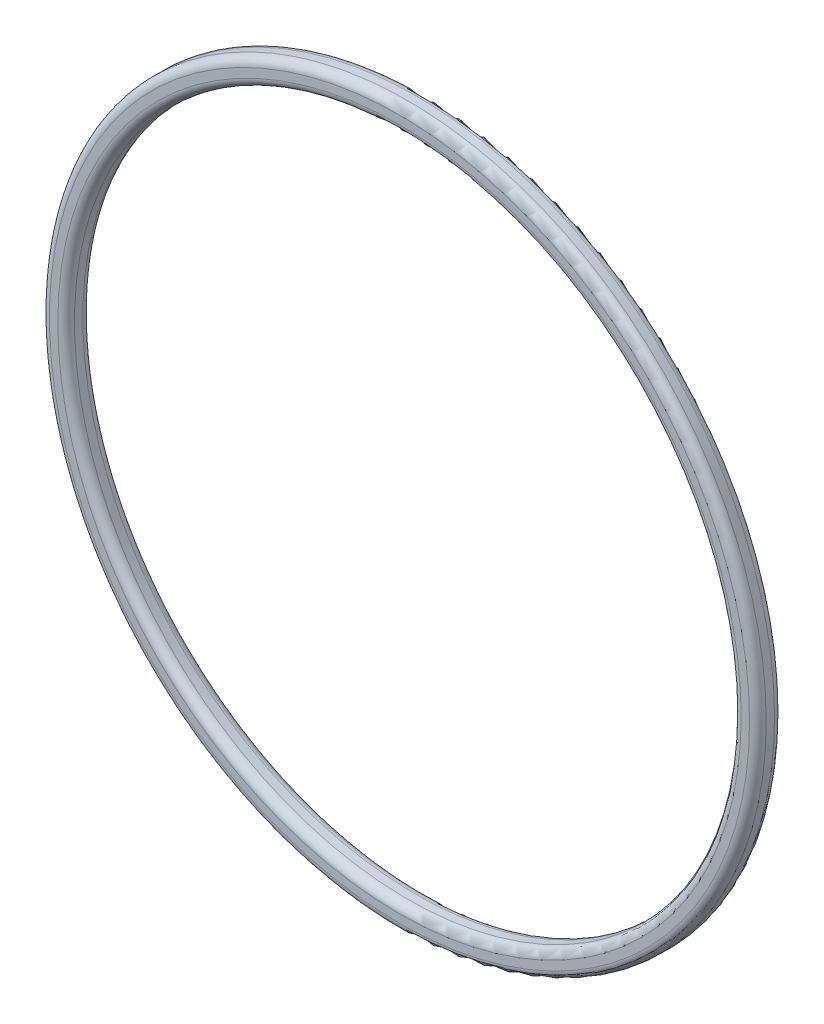
ISO-10303-21;
HEADER;
FILE_DESCRIPTION(('STEP AP214'),'2;1');
FILE_NAME('part.step','',(''),(''),'','','');
FILE_SCHEMA(('AUTOMOTIVE_DESIGN { 1 0 10303 214 1 1 1 1 }'));
ENDSEC;
DATA;
#1=APPLICATION_CONTEXT('core data for automotive mechanical design processes');
#2=APPLICATION_PROTOCOL_DEFINITION('international standard','automotive_design',2000,#1);
#3=PRODUCT_CONTEXT('',#1,'mechanical');
#4=PRODUCT('Part','Part','',(#3));
#5=PRODUCT_RELATED_PRODUCT_CATEGORY('part','',(#4));
#6=PRODUCT_DEFINITION_FORMATION('','',#4);
#7=PRODUCT_DEFINITION_CONTEXT('part definition',#1,'design');
#8=PRODUCT_DEFINITION('design','',#6,#7);
#9=PRODUCT_DEFINITION_SHAPE('','',#8);
#10=(LENGTH_UNIT() NAMED_UNIT(*) SI_UNIT(.MILLI.,.METRE.));
#11=(NAMED_UNIT(*) PLANE_ANGLE_UNIT() SI_UNIT($,.RADIAN.));
#12=(NAMED_UNIT(*) SI_UNIT($,.STERADIAN.) SOLID_ANGLE_UNIT());
#13=UNCERTAINTY_MEASURE_WITH_UNIT(LENGTH_MEASURE(1.E-05),#10,'distance_accuracy_value','');
#14=(GEOMETRIC_REPRESENTATION_CONTEXT(3) GLOBAL_UNCERTAINTY_ASSIGNED_CONTEXT((#13)) GLOBAL_UNIT_ASSIGNED_CONTEXT((#10,
#11,#12)) REPRESENTATION_CONTEXT('',''));
#15=CARTESIAN_POINT('',(0.,0.,0.));
#16=DIRECTION('',(0.,0.,1.));
#17=DIRECTION('',(1.,0.,0.));
#18=AXIS2_PLACEMENT_3D('',#15,#16,#17);
#19=CARTESIAN_POINT('',(0.,0.,3.));
#20=DIRECTION('',(0.,0.,1.));
#21=DIRECTION('',(1.,0.,0.));
#22=AXIS2_PLACEMENT_3D('',#19,#20,#21);
#23=PLANE('',#22);
#24=CARTESIAN_POINT('',(0.,0.,3.));
#25=DIRECTION('',(0.,0.,1.));
#26=DIRECTION('',(1.,0.,0.));
#27=AXIS2_PLACEMENT_3D('',#24,#25,#26);
#28=CIRCLE('',#27,41.);
#29=CARTESIAN_POINT('',(41.,0.,3.));
#30=VERTEX_POINT('',#29);
#31=EDGE_CURVE('E10',#30,#30,#28,.F.);
#32=ORIENTED_EDGE('',*,*,#31,.T.);
#33=EDGE_LOOP('',(#32));
#34=FACE_BOUND('',#33,.T.);
#35=CARTESIAN_POINT('',(0.,0.,3.));
#36=DIRECTION('',(0.,0.,1.));
#37=DIRECTION('',(1.,0.,0.));
#38=AXIS2_PLACEMENT_3D('',#35,#36,#37);
#39=CIRCLE('',#38,42.);
#40=CARTESIAN_POINT('',(42.,0.,3.));
#41=VERTEX_POINT('',#40);
#42=EDGE_CURVE('E45',#41,#41,#39,.T.);
#43=ORIENTED_EDGE('',*,*,#42,.T.);
#44=EDGE_LOOP('',(#43));
#45=FACE_BOUND('',#44,.T.);
#46=ADVANCED_FACE('F37',(#34,#45),#23,.T.);
#47=CARTESIAN_POINT('',(0.,0.,0.));
#48=DIRECTION('',(0.,0.,1.));
#49=DIRECTION('',(1.,0.,0.));
#50=AXIS2_PLACEMENT_3D('',#47,#48,#49);
#51=PLANE('',#50);
#52=CARTESIAN_POINT('',(0.,0.,0.));
#53=DIRECTION('',(0.,0.,1.));
#54=DIRECTION('',(1.,0.,0.));
#55=AXIS2_PLACEMENT_3D('',#52,#53,#54);
#56=CIRCLE('',#55,41.);
#57=CARTESIAN_POINT('',(41.,0.,0.));
#58=VERTEX_POINT('',#57);
#59=EDGE_CURVE('E69',#58,#58,#56,.T.);
#60=ORIENTED_EDGE('',*,*,#59,.T.);
#61=EDGE_LOOP('',(#60));
#62=FACE_BOUND('',#61,.T.);
#63=CARTESIAN_POINT('',(0.,0.,0.));
#64=DIRECTION('',(0.,0.,1.));
#65=DIRECTION('',(1.,0.,0.));
#66=AXIS2_PLACEMENT_3D('',#63,#64,#65);
#67=CIRCLE('',#66,42.);
#68=CARTESIAN_POINT('',(42.,0.,0.));
#69=VERTEX_POINT('',#68);
#70=EDGE_CURVE('E73',#69,#69,#67,.F.);
#71=ORIENTED_EDGE('',*,*,#70,.T.);
#72=EDGE_LOOP('',(#71));
#73=FACE_BOUND('',#72,.T.);
#74=ADVANCED_FACE('F78',(#62,#73),#51,.F.);
#75=CARTESIAN_POINT('',(0.,0.,3.));
#76=DIRECTION('',(0.,0.,-1.));
#77=DIRECTION('',(-1.,0.,0.));
#78=AXIS2_PLACEMENT_3D('',#75,#76,#77);
#79=CYLINDRICAL_SURFACE('',#78,43.);
#80=CARTESIAN_POINT('',(0.,0.,1.));
#81=DIRECTION('',(0.,0.,1.));
#82=DIRECTION('',(1.,0.,0.));
#83=AXIS2_PLACEMENT_3D('',#80,#81,#82);
#84=CIRCLE('',#83,43.);
#85=CARTESIAN_POINT('',(43.,0.,1.));
#86=VERTEX_POINT('',#85);
#87=EDGE_CURVE('E50',#86,#86,#84,.T.);
#88=ORIENTED_EDGE('',*,*,#87,.T.);
#89=EDGE_LOOP('',(#88));
#90=FACE_BOUND('',#89,.T.);
#91=CARTESIAN_POINT('',(0.,0.,2.));
#92=DIRECTION('',(0.,0.,1.));
#93=DIRECTION('',(1.,0.,0.));
#94=AXIS2_PLACEMENT_3D('',#91,#92,#93);
#95=CIRCLE('',#94,43.);
#96=CARTESIAN_POINT('',(43.,0.,2.));
#97=VERTEX_POINT('',#96);
#98=EDGE_CURVE('E55',#97,#97,#95,.F.);
#99=ORIENTED_EDGE('',*,*,#98,.T.);
#100=EDGE_LOOP('',(#99));
#101=FACE_BOUND('',#100,.T.);
#102=ADVANCED_FACE('F88',(#90,#101),#79,.T.);
#103=CARTESIAN_POINT('',(0.,0.,3.));
#104=DIRECTION('',(0.,0.,-1.));
#105=DIRECTION('',(-1.,0.,0.));
#106=AXIS2_PLACEMENT_3D('',#103,#104,#105);
#107=CYLINDRICAL_SURFACE('',#106,40.);
#108=CARTESIAN_POINT('',(0.,0.,1.));
#109=DIRECTION('',(0.,0.,1.));
#110=DIRECTION('',(1.,0.,0.));
#111=AXIS2_PLACEMENT_3D('',#108,#109,#110);
#112=CIRCLE('',#111,40.);
#113=CARTESIAN_POINT('',(40.,0.,1.));
#114=VERTEX_POINT('',#113);
#115=EDGE_CURVE('E61',#114,#114,#112,.F.);
#116=ORIENTED_EDGE('',*,*,#115,.T.);
#117=EDGE_LOOP('',(#116));
#118=FACE_BOUND('',#117,.T.);
#119=CARTESIAN_POINT('',(0.,0.,2.));
#120=DIRECTION('',(0.,0.,1.));
#121=DIRECTION('',(1.,0.,0.));
#122=AXIS2_PLACEMENT_3D('',#119,#120,#121);
#123=CIRCLE('',#122,40.);
#124=CARTESIAN_POINT('',(40.,0.,2.));
#125=VERTEX_POINT('',#124);
#126=EDGE_CURVE('E65',#125,#125,#123,.T.);
#127=ORIENTED_EDGE('',*,*,#126,.T.);
#128=EDGE_LOOP('',(#127));
#129=FACE_BOUND('',#128,.T.);
#130=ADVANCED_FACE('F91',(#118,#129),#107,.F.);
#131=CARTESIAN_POINT('',(0.,0.,1.));
#132=DIRECTION('',(0.,0.,1.));
#133=DIRECTION('',(1.,0.,0.));
#134=AXIS2_PLACEMENT_3D('',#131,#132,#133);
#135=TOROIDAL_SURFACE('',#134,41.,1.);
#136=ORIENTED_EDGE('',*,*,#115,.F.);
#137=EDGE_LOOP('',(#136));
#138=FACE_BOUND('',#137,.T.);
#139=ORIENTED_EDGE('',*,*,#59,.F.);
#140=EDGE_LOOP('',(#139));
#141=FACE_BOUND('',#140,.T.);
#142=ADVANCED_FACE('F84',(#138,#141),#135,.T.);
#143=CARTESIAN_POINT('',(0.,0.,1.));
#144=DIRECTION('',(0.,0.,1.));
#145=DIRECTION('',(1.,0.,0.));
#146=AXIS2_PLACEMENT_3D('',#143,#144,#145);
#147=TOROIDAL_SURFACE('',#146,42.,1.);
#148=ORIENTED_EDGE('',*,*,#70,.F.);
#149=EDGE_LOOP('',(#148));
#150=FACE_BOUND('',#149,.T.);
#151=ORIENTED_EDGE('',*,*,#87,.F.);
#152=EDGE_LOOP('',(#151));
#153=FACE_BOUND('',#152,.T.);
#154=ADVANCED_FACE('F80',(#150,#153),#147,.T.);
#155=CARTESIAN_POINT('',(0.,0.,2.));
#156=DIRECTION('',(0.,0.,1.));
#157=DIRECTION('',(1.,0.,0.));
#158=AXIS2_PLACEMENT_3D('',#155,#156,#157);
#159=TOROIDAL_SURFACE('',#158,41.,1.);
#160=ORIENTED_EDGE('',*,*,#31,.F.);
#161=EDGE_LOOP('',(#160));
#162=FACE_BOUND('',#161,.T.);
#163=ORIENTED_EDGE('',*,*,#126,.F.);
#164=EDGE_LOOP('',(#163));
#165=FACE_BOUND('',#164,.T.);
#166=ADVANCED_FACE('F83',(#162,#165),#159,.T.);
#167=CARTESIAN_POINT('',(0.,0.,2.));
#168=DIRECTION('',(0.,0.,1.));
#169=DIRECTION('',(1.,0.,0.));
#170=AXIS2_PLACEMENT_3D('',#167,#168,#169);
#171=TOROIDAL_SURFACE('',#170,42.,1.);
#172=ORIENTED_EDGE('',*,*,#98,.F.);
#173=EDGE_LOOP('',(#172));
#174=FACE_BOUND('',#173,.T.);
#175=ORIENTED_EDGE('',*,*,#42,.F.);
#176=EDGE_LOOP('',(#175));
#177=FACE_BOUND('',#176,.T.);
#178=ADVANCED_FACE('F39',(#174,#177),#171,.T.);
#179=CLOSED_SHELL('',(#46,#74,#102,#130,#142,#154,#166,#178));
#180=MANIFOLD_SOLID_BREP('B2',#179);
#181=ADVANCED_BREP_SHAPE_REPRESENTATION('',(#18,#180),#14);
#182=SHAPE_DEFINITION_REPRESENTATION(#9,#181);
ENDSEC;
END-ISO-10303-21;
